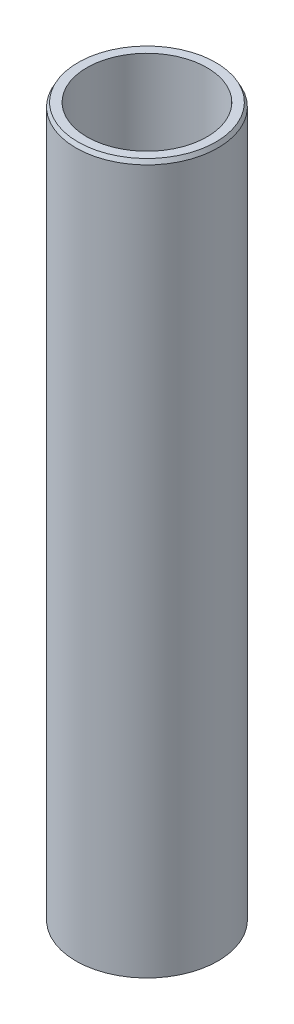
ISO-10303-21;
HEADER;
FILE_DESCRIPTION(('STEP AP214'),'2;1');
FILE_NAME('part.step','',(''),(''),'','','');
FILE_SCHEMA(('AUTOMOTIVE_DESIGN { 1 0 10303 214 1 1 1 1 }'));
ENDSEC;
DATA;
#1=APPLICATION_CONTEXT('core data for automotive mechanical design processes');
#2=APPLICATION_PROTOCOL_DEFINITION('international standard','automotive_design',2000,#1);
#3=PRODUCT_CONTEXT('',#1,'mechanical');
#4=PRODUCT('Part','Part','',(#3));
#5=PRODUCT_RELATED_PRODUCT_CATEGORY('part','',(#4));
#6=PRODUCT_DEFINITION_FORMATION('','',#4);
#7=PRODUCT_DEFINITION_CONTEXT('part definition',#1,'design');
#8=PRODUCT_DEFINITION('design','',#6,#7);
#9=PRODUCT_DEFINITION_SHAPE('','',#8);
#10=(LENGTH_UNIT() NAMED_UNIT(*) SI_UNIT(.MILLI.,.METRE.));
#11=(NAMED_UNIT(*) PLANE_ANGLE_UNIT() SI_UNIT($,.RADIAN.));
#12=(NAMED_UNIT(*) SI_UNIT($,.STERADIAN.) SOLID_ANGLE_UNIT());
#13=UNCERTAINTY_MEASURE_WITH_UNIT(LENGTH_MEASURE(1.E-05),#10,'distance_accuracy_value','');
#14=(GEOMETRIC_REPRESENTATION_CONTEXT(3) GLOBAL_UNCERTAINTY_ASSIGNED_CONTEXT((#13)) GLOBAL_UNIT_ASSIGNED_CONTEXT((#10,
#11,#12)) REPRESENTATION_CONTEXT('',''));
#15=CARTESIAN_POINT('',(0.,0.,0.));
#16=DIRECTION('',(0.,0.,1.));
#17=DIRECTION('',(1.,0.,0.));
#18=AXIS2_PLACEMENT_3D('',#15,#16,#17);
#19=CARTESIAN_POINT('',(0.,600.,0.));
#20=DIRECTION('',(0.,-1.,0.));
#21=DIRECTION('',(0.,0.,-1.));
#22=AXIS2_PLACEMENT_3D('',#19,#20,#21);
#23=CYLINDRICAL_SURFACE('',#22,60.);
#24=CARTESIAN_POINT('',(0.,596.576543724247,0.));
#25=DIRECTION('',(0.,1.,0.));
#26=DIRECTION('',(0.,0.,1.));
#27=AXIS2_PLACEMENT_3D('',#24,#25,#26);
#28=CIRCLE('',#27,60.);
#29=CARTESIAN_POINT('',(0.,596.576543724247,60.));
#30=VERTEX_POINT('',#29);
#31=EDGE_CURVE('E50',#30,#30,#28,.F.);
#32=ORIENTED_EDGE('',*,*,#31,.T.);
#33=EDGE_LOOP('',(#32));
#34=FACE_BOUND('',#33,.T.);
#35=CARTESIAN_POINT('',(0.,1.80039254080033,0.));
#36=DIRECTION('',(0.,1.,0.));
#37=DIRECTION('',(0.,0.,1.));
#38=AXIS2_PLACEMENT_3D('',#35,#36,#37);
#39=CIRCLE('',#38,60.);
#40=CARTESIAN_POINT('',(0.,1.80039254080033,60.));
#41=VERTEX_POINT('',#40);
#42=EDGE_CURVE('E51',#41,#41,#39,.T.);
#43=ORIENTED_EDGE('',*,*,#42,.T.);
#44=EDGE_LOOP('',(#43));
#45=FACE_BOUND('',#44,.T.);
#46=ADVANCED_FACE('F39',(#34,#45),#23,.T.);
#47=CARTESIAN_POINT('',(0.,600.,0.));
#48=DIRECTION('',(0.,1.,0.));
#49=DIRECTION('',(0.,0.,1.));
#50=AXIS2_PLACEMENT_3D('',#47,#48,#49);
#51=PLANE('',#50);
#52=CARTESIAN_POINT('',(0.,600.,0.));
#53=DIRECTION('',(0.,1.,0.));
#54=DIRECTION('',(0.,0.,1.));
#55=AXIS2_PLACEMENT_3D('',#52,#53,#54);
#56=CIRCLE('',#55,58.1996074591996);
#57=CARTESIAN_POINT('',(0.,600.,58.1996074591996));
#58=VERTEX_POINT('',#57);
#59=EDGE_CURVE('E54',#58,#58,#56,.T.);
#60=ORIENTED_EDGE('',*,*,#59,.T.);
#61=EDGE_LOOP('',(#60));
#62=FACE_BOUND('',#61,.T.);
#63=CARTESIAN_POINT('',(0.,600.,0.));
#64=DIRECTION('',(0.,1.,0.));
#65=DIRECTION('',(0.,0.,1.));
#66=AXIS2_PLACEMENT_3D('',#63,#64,#65);
#67=CIRCLE('',#66,50.7146539019166);
#68=CARTESIAN_POINT('',(0.,600.,50.7146539019166));
#69=VERTEX_POINT('',#68);
#70=EDGE_CURVE('E58',#69,#69,#67,.T.);
#71=ORIENTED_EDGE('',*,*,#70,.F.);
#72=EDGE_LOOP('',(#71));
#73=FACE_BOUND('',#72,.T.);
#74=ADVANCED_FACE('F69',(#62,#73),#51,.T.);
#75=CARTESIAN_POINT('',(0.,0.,0.));
#76=DIRECTION('',(0.,1.,0.));
#77=DIRECTION('',(0.,0.,1.));
#78=AXIS2_PLACEMENT_3D('',#75,#76,#77);
#79=PLANE('',#78);
#80=CARTESIAN_POINT('',(0.,0.,0.));
#81=DIRECTION('',(0.,1.,0.));
#82=DIRECTION('',(0.,0.,1.));
#83=AXIS2_PLACEMENT_3D('',#80,#81,#82);
#84=CIRCLE('',#83,56.5765437242474);
#85=CARTESIAN_POINT('',(0.,0.,56.5765437242474));
#86=VERTEX_POINT('',#85);
#87=EDGE_CURVE('E10',#86,#86,#84,.F.);
#88=ORIENTED_EDGE('',*,*,#87,.T.);
#89=EDGE_LOOP('',(#88));
#90=FACE_BOUND('',#89,.T.);
#91=CARTESIAN_POINT('',(0.,0.,0.));
#92=DIRECTION('',(0.,1.,0.));
#93=DIRECTION('',(0.,0.,1.));
#94=AXIS2_PLACEMENT_3D('',#91,#92,#93);
#95=CIRCLE('',#94,50.7146539019166);
#96=CARTESIAN_POINT('',(0.,0.,50.7146539019166));
#97=VERTEX_POINT('',#96);
#98=EDGE_CURVE('E63',#97,#97,#95,.T.);
#99=ORIENTED_EDGE('',*,*,#98,.T.);
#100=EDGE_LOOP('',(#99));
#101=FACE_BOUND('',#100,.T.);
#102=ADVANCED_FACE('F75',(#90,#101),#79,.F.);
#103=CARTESIAN_POINT('',(0.,600.,0.));
#104=DIRECTION('',(0.,-1.,0.));
#105=DIRECTION('',(0.,0.,-1.));
#106=AXIS2_PLACEMENT_3D('',#103,#104,#105);
#107=CYLINDRICAL_SURFACE('',#106,50.7146539019166);
#108=ORIENTED_EDGE('',*,*,#70,.T.);
#109=EDGE_LOOP('',(#108));
#110=FACE_BOUND('',#109,.T.);
#111=ORIENTED_EDGE('',*,*,#98,.F.);
#112=EDGE_LOOP('',(#111));
#113=FACE_BOUND('',#112,.T.);
#114=ADVANCED_FACE('F70',(#110,#113),#107,.F.);
#115=CARTESIAN_POINT('',(0.,600.,0.));
#116=DIRECTION('',(0.,-1.,0.));
#117=DIRECTION('',(0.,0.,-1.));
#118=AXIS2_PLACEMENT_3D('',#115,#116,#117);
#119=CONICAL_SURFACE('',#118,58.1996074591996,0.484151564032205);
#120=ORIENTED_EDGE('',*,*,#31,.F.);
#121=EDGE_LOOP('',(#120));
#122=FACE_BOUND('',#121,.T.);
#123=ORIENTED_EDGE('',*,*,#59,.F.);
#124=EDGE_LOOP('',(#123));
#125=FACE_BOUND('',#124,.T.);
#126=ADVANCED_FACE('F81',(#122,#125),#119,.T.);
#127=CARTESIAN_POINT('',(0.,1.80039254080033,0.));
#128=DIRECTION('',(0.,1.,0.));
#129=DIRECTION('',(0.,0.,1.));
#130=AXIS2_PLACEMENT_3D('',#127,#128,#129);
#131=CONICAL_SURFACE('',#130,60.,1.08664476276269);
#132=CARTESIAN_POINT('',(0.,0.,56.5765437242474));
#133=CARTESIAN_POINT('',(0.,0.0187540889666715,56.6122047271199));
#134=CARTESIAN_POINT('',(0.,0.0375081779333411,56.6478657299923));
#135=CARTESIAN_POINT('',(0.,0.0750163558666802,56.7191877357371));
#136=CARTESIAN_POINT('',(0.,0.0937704448333498,56.7548487386095));
#137=CARTESIAN_POINT('',(0.,0.13127862276669,56.8261707443544));
#138=CARTESIAN_POINT('',(0.,0.150032711733361,56.8618317472268));
#139=CARTESIAN_POINT('',(0.,0.187540889666702,56.9331537529716));
#140=CARTESIAN_POINT('',(0.,0.206294978633371,56.9688147558441));
#141=CARTESIAN_POINT('',(0.,0.243803156566711,57.0401367615889));
#142=CARTESIAN_POINT('',(0.,0.262557245533382,57.0757977644613));
#143=CARTESIAN_POINT('',(0.,0.300065423466722,57.1471197702062));
#144=CARTESIAN_POINT('',(0.,0.318819512433392,57.1827807730786));
#145=CARTESIAN_POINT('',(0.,0.356327690366732,57.2541027788235));
#146=CARTESIAN_POINT('',(0.,0.375081779333403,57.2897637816959));
#147=CARTESIAN_POINT('',(0.,0.412589957266743,57.3610857874407));
#148=CARTESIAN_POINT('',(0.,0.431344046233412,57.3967467903131));
#149=CARTESIAN_POINT('',(0.,0.468852224166753,57.468068796058));
#150=CARTESIAN_POINT('',(0.,0.487606313133424,57.5037297989304));
#151=CARTESIAN_POINT('',(0.,0.525114491066764,57.5750518046753));
#152=CARTESIAN_POINT('',(0.,0.543868580033433,57.6107128075477));
#153=CARTESIAN_POINT('',(0.,0.581376757966773,57.6820348132925));
#154=CARTESIAN_POINT('',(0.,0.600130846933445,57.7176958161649));
#155=CARTESIAN_POINT('',(0.,0.637639024866785,57.7890178219098));
#156=CARTESIAN_POINT('',(0.,0.656393113833454,57.8246788247822));
#157=CARTESIAN_POINT('',(0.,0.693901291766795,57.8960008305271));
#158=CARTESIAN_POINT('',(0.,0.712655380733466,57.9316618333995));
#159=CARTESIAN_POINT('',(0.,0.750163558666806,58.0029838391443));
#160=CARTESIAN_POINT('',(0.,0.768917647633475,58.0386448420168));
#161=CARTESIAN_POINT('',(0.,0.806425825566815,58.1099668477616));
#162=CARTESIAN_POINT('',(0.,0.825179914533485,58.145627850634));
#163=CARTESIAN_POINT('',(0.,0.862688092466826,58.2169498563789));
#164=CARTESIAN_POINT('',(0.,0.881442181433497,58.2526108592513));
#165=CARTESIAN_POINT('',(0.,0.918950359366837,58.3239328649961));
#166=CARTESIAN_POINT('',(0.,0.937704448333506,58.3595938678686));
#167=CARTESIAN_POINT('',(0.,0.975212626266846,58.4309158736134));
#168=CARTESIAN_POINT('',(0.,0.993966715233518,58.4665768764858));
#169=CARTESIAN_POINT('',(0.,1.03147489316686,58.5378988822307));
#170=CARTESIAN_POINT('',(0.,1.05022898213353,58.5735598851031));
#171=CARTESIAN_POINT('',(0.,1.08773716006687,58.6448818908479));
#172=CARTESIAN_POINT('',(0.,1.10649124903354,58.6805428937204));
#173=CARTESIAN_POINT('',(0.,1.14399942696688,58.7518648994652));
#174=CARTESIAN_POINT('',(0.,1.16275351593355,58.7875259023376));
#175=CARTESIAN_POINT('',(0.,1.20026169386689,58.8588479080825));
#176=CARTESIAN_POINT('',(0.,1.21901578283356,58.8945089109549));
#177=CARTESIAN_POINT('',(0.,1.2565239607669,58.9658309166997));
#178=CARTESIAN_POINT('',(0.,1.27527804973357,59.0014919195722));
#179=CARTESIAN_POINT('',(0.,1.31278622766691,59.072813925317));
#180=CARTESIAN_POINT('',(0.,1.33154031663358,59.1084749281894));
#181=CARTESIAN_POINT('',(0.,1.36904849456692,59.1797969339343));
#182=CARTESIAN_POINT('',(0.,1.38780258353359,59.2154579368067));
#183=CARTESIAN_POINT('',(0.,1.42531076146693,59.2867799425515));
#184=CARTESIAN_POINT('',(0.,1.4440648504336,59.322440945424));
#185=CARTESIAN_POINT('',(0.,1.48157302836694,59.3937629511688));
#186=CARTESIAN_POINT('',(0.,1.50032711733361,59.4294239540412));
#187=CARTESIAN_POINT('',(0.,1.53783529526695,59.5007459597861));
#188=CARTESIAN_POINT('',(0.,1.55658938423362,59.5364069626585));
#189=CARTESIAN_POINT('',(0.,1.59409756216696,59.6077289684034));
#190=CARTESIAN_POINT('',(0.,1.61285165113363,59.6433899712758));
#191=CARTESIAN_POINT('',(0.,1.65035982906697,59.7147119770206));
#192=CARTESIAN_POINT('',(0.,1.66911391803364,59.750372979893));
#193=CARTESIAN_POINT('',(0.,1.70662209596698,59.8216949856379));
#194=CARTESIAN_POINT('',(0.,1.72537618493365,59.8573559885103));
#195=CARTESIAN_POINT('',(0.,1.76288436286699,59.9286779942552));
#196=CARTESIAN_POINT('',(0.,1.78163845183366,59.9643389971276));
#197=CARTESIAN_POINT('',(0.,1.80039254080033,60.));
#198=B_SPLINE_CURVE_WITH_KNOTS('',3,(#132,#133,#134,#135,#136,#137,#138,#139,#140,#141,#142,
#143,#144,#145,#146,#147,#148,#149,#150,#151,#152,#153,#154,#155,#156,#157,#158,#159,#160,#161,
#162,#163,#164,#165,#166,#167,#168,#169,#170,#171,#172,#173,#174,#175,#176,#177,#178,#179,#180,
#181,#182,#183,#184,#185,#186,#187,#188,#189,#190,#191,#192,#193,#194,#195,#196,#197),
.UNSPECIFIED.,.F.,.F.,(4,2,2,2,2,2,2,2,2,2,2,2,2,2,2,2,2,2,2,2,2,2,2,2,2,2,2,2,2,2,2,2,4),(0.,
0.120875170359879,0.241750340719764,0.362625511079643,0.483500681439528,0.604375851799406,
0.725251022159291,0.84612619251917,0.967001362879055,1.08787653323893,1.20875170359882,
1.3296268739587,1.45050204431858,1.57137721467846,1.69225238503835,1.81312755539822,
1.9340027257581,2.05487789611799,2.17575306647787,2.29662823683775,2.41750340719763,
2.53837857755752,2.6592537479174,2.78012891827728,2.90100408863716,3.02187925899704,
3.14275442935692,3.26362959971681,3.38450477007669,3.50537994043657,3.62625511079645,
3.74713028115634,3.86800545151621),.UNSPECIFIED.);
#199=EDGE_CURVE('BSEAM45',#86,#41,#198,.T.);
#200=ORIENTED_EDGE('',*,*,#87,.F.);
#201=ORIENTED_EDGE('',*,*,#42,.F.);
#202=ORIENTED_EDGE('',*,*,#199,.T.);
#203=ORIENTED_EDGE('',*,*,#199,.F.);
#204=EDGE_LOOP('',(#200,#202,#201,#203));
#205=FACE_BOUND('',#204,.T.);
#206=ADVANCED_FACE('F45',(#205),#131,.T.);
#207=CLOSED_SHELL('',(#46,#74,#102,#114,#126,#206));
#208=MANIFOLD_SOLID_BREP('B2',#207);
#209=ADVANCED_BREP_SHAPE_REPRESENTATION('',(#18,#208),#14);
#210=SHAPE_DEFINITION_REPRESENTATION(#9,#209);
ENDSEC;
END-ISO-10303-21;
